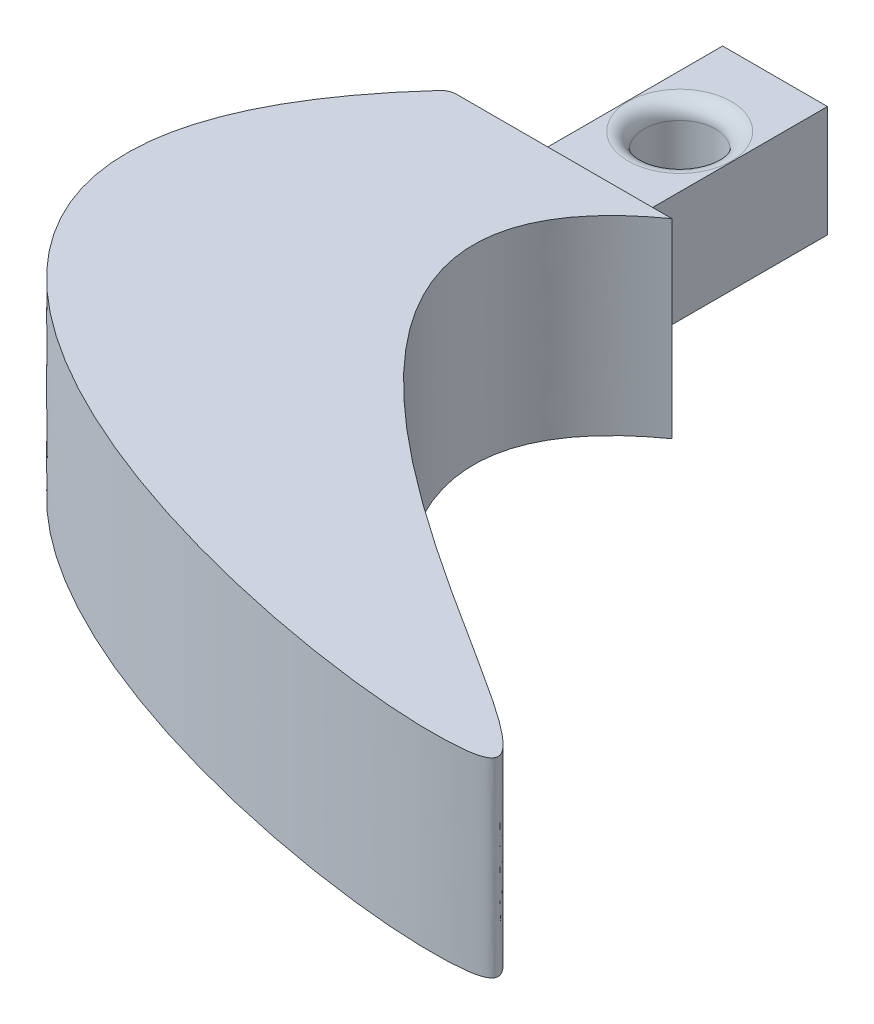
ISO-10303-21;
HEADER;
FILE_DESCRIPTION(('STEP AP214'),'2;1');
FILE_NAME('part.step','',(''),(''),'','','');
FILE_SCHEMA(('AUTOMOTIVE_DESIGN { 1 0 10303 214 1 1 1 1 }'));
ENDSEC;
DATA;
#1=APPLICATION_CONTEXT('core data for automotive mechanical design processes');
#2=APPLICATION_PROTOCOL_DEFINITION('international standard','automotive_design',2000,#1);
#3=PRODUCT_CONTEXT('',#1,'mechanical');
#4=PRODUCT('Part','Part','',(#3));
#5=PRODUCT_RELATED_PRODUCT_CATEGORY('part','',(#4));
#6=PRODUCT_DEFINITION_FORMATION('','',#4);
#7=PRODUCT_DEFINITION_CONTEXT('part definition',#1,'design');
#8=PRODUCT_DEFINITION('design','',#6,#7);
#9=PRODUCT_DEFINITION_SHAPE('','',#8);
#10=(LENGTH_UNIT() NAMED_UNIT(*) SI_UNIT(.MILLI.,.METRE.));
#11=(NAMED_UNIT(*) PLANE_ANGLE_UNIT() SI_UNIT($,.RADIAN.));
#12=(NAMED_UNIT(*) SI_UNIT($,.STERADIAN.) SOLID_ANGLE_UNIT());
#13=UNCERTAINTY_MEASURE_WITH_UNIT(LENGTH_MEASURE(1.E-05),#10,'distance_accuracy_value','');
#14=(GEOMETRIC_REPRESENTATION_CONTEXT(3) GLOBAL_UNCERTAINTY_ASSIGNED_CONTEXT((#13)) GLOBAL_UNIT_ASSIGNED_CONTEXT((#10,
#11,#12)) REPRESENTATION_CONTEXT('',''));
#15=CARTESIAN_POINT('',(0.,0.,0.));
#16=DIRECTION('',(0.,0.,1.));
#17=DIRECTION('',(1.,0.,0.));
#18=AXIS2_PLACEMENT_3D('',#15,#16,#17);
#19=CARTESIAN_POINT('',(2.99181733122528,-3.99279277164537,14.));
#20=DIRECTION('',(0.,1.,0.));
#21=DIRECTION('',(-1.,0.,0.));
#22=AXIS2_PLACEMENT_3D('',#19,#20,#21);
#23=PLANE('',#22);
#24=CARTESIAN_POINT('',(-0.508182668774722,-3.99279277164539,6.));
#25=DIRECTION('',(0.,1.,0.));
#26=DIRECTION('',(-1.,0.,0.));
#27=AXIS2_PLACEMENT_3D('',#24,#25,#26);
#28=CIRCLE('',#27,3.25);
#29=CARTESIAN_POINT('',(-3.75818266877472,-3.99279277164539,6.));
#30=VERTEX_POINT('',#29);
#31=EDGE_CURVE('E150',#30,#30,#28,.T.);
#32=ORIENTED_EDGE('',*,*,#31,.T.);
#33=EDGE_LOOP('',(#32));
#34=FACE_BOUND('',#33,.T.);
#35=DIRECTION('',(0.,0.,1.));
#36=VECTOR('',#35,1.);
#37=CARTESIAN_POINT('',(-3.80818266877472,-3.99279277164537,14.));
#38=LINE('',#37,#36);
#39=CARTESIAN_POINT('',(-3.80818266877472,-3.99279277164539,0.));
#40=VERTEX_POINT('',#39);
#41=CARTESIAN_POINT('',(-3.80818266877472,-3.99279277164537,14.));
#42=VERTEX_POINT('',#41);
#43=EDGE_CURVE('E174',#40,#42,#38,.T.);
#44=ORIENTED_EDGE('',*,*,#43,.F.);
#45=DIRECTION('',(1.,0.,0.));
#46=VECTOR('',#45,1.);
#47=CARTESIAN_POINT('',(2.99181733122528,-3.99279277164539,0.));
#48=LINE('',#47,#46);
#49=CARTESIAN_POINT('',(2.79181733122528,-3.99279277164539,0.));
#50=VERTEX_POINT('',#49);
#51=EDGE_CURVE('E120',#40,#50,#48,.T.);
#52=ORIENTED_EDGE('',*,*,#51,.T.);
#53=DIRECTION('',(0.,0.,1.));
#54=VECTOR('',#53,1.);
#55=CARTESIAN_POINT('',(2.79181733122528,-3.99279277164537,14.));
#56=LINE('',#55,#54);
#57=CARTESIAN_POINT('',(2.79181733122528,-3.99279277164537,14.));
#58=VERTEX_POINT('',#57);
#59=EDGE_CURVE('E178',#50,#58,#56,.T.);
#60=ORIENTED_EDGE('',*,*,#59,.T.);
#61=DIRECTION('',(1.,0.,0.));
#62=VECTOR('',#61,1.);
#63=CARTESIAN_POINT('',(2.99181733122528,-3.99279277164537,14.));
#64=LINE('',#63,#62);
#65=EDGE_CURVE('E125',#42,#58,#64,.T.);
#66=ORIENTED_EDGE('',*,*,#65,.F.);
#67=EDGE_LOOP('',(#44,#52,#60,#66));
#68=FACE_BOUND('',#67,.T.);
#69=ADVANCED_FACE('F40',(#34,#68),#23,.F.);
#70=CARTESIAN_POINT('',(2.99181733122528,3.00720722835462,14.));
#71=DIRECTION('',(0.,-1.,0.));
#72=DIRECTION('',(1.,0.,0.));
#73=AXIS2_PLACEMENT_3D('',#70,#71,#72);
#74=PLANE('',#73);
#75=CARTESIAN_POINT('',(-0.508182668774722,3.00720722835462,6.));
#76=DIRECTION('',(0.,-1.,0.));
#77=DIRECTION('',(1.,0.,0.));
#78=AXIS2_PLACEMENT_3D('',#75,#76,#77);
#79=CIRCLE('',#78,3.25);
#80=CARTESIAN_POINT('',(2.74181733122528,3.00720722835462,6.));
#81=VERTEX_POINT('',#80);
#82=EDGE_CURVE('E11',#81,#81,#79,.T.);
#83=ORIENTED_EDGE('',*,*,#82,.T.);
#84=EDGE_LOOP('',(#83));
#85=FACE_BOUND('',#84,.T.);
#86=DIRECTION('',(0.,0.,1.));
#87=VECTOR('',#86,1.);
#88=CARTESIAN_POINT('',(-3.80818266877472,3.00720722835461,0.));
#89=LINE('',#88,#87);
#90=CARTESIAN_POINT('',(-3.80818266877472,3.00720722835461,0.));
#91=VERTEX_POINT('',#90);
#92=CARTESIAN_POINT('',(-3.80818266877472,3.00720722835461,14.));
#93=VERTEX_POINT('',#92);
#94=EDGE_CURVE('E100',#91,#93,#89,.T.);
#95=ORIENTED_EDGE('',*,*,#94,.T.);
#96=DIRECTION('',(-1.,0.,0.));
#97=VECTOR('',#96,1.);
#98=CARTESIAN_POINT('',(2.99181733122528,3.00720722835462,14.));
#99=LINE('',#98,#97);
#100=CARTESIAN_POINT('',(2.79181733122528,3.00720722835461,14.));
#101=VERTEX_POINT('',#100);
#102=EDGE_CURVE('E131',#101,#93,#99,.T.);
#103=ORIENTED_EDGE('',*,*,#102,.F.);
#104=DIRECTION('',(0.,0.,1.));
#105=VECTOR('',#104,1.);
#106=CARTESIAN_POINT('',(2.79181733122528,3.00720722835461,0.));
#107=LINE('',#106,#105);
#108=CARTESIAN_POINT('',(2.79181733122528,3.00720722835461,0.));
#109=VERTEX_POINT('',#108);
#110=EDGE_CURVE('E56',#109,#101,#107,.T.);
#111=ORIENTED_EDGE('',*,*,#110,.F.);
#112=DIRECTION('',(-1.,0.,0.));
#113=VECTOR('',#112,1.);
#114=CARTESIAN_POINT('',(2.99181733122528,3.00720722835461,0.));
#115=LINE('',#114,#113);
#116=EDGE_CURVE('E118',#109,#91,#115,.T.);
#117=ORIENTED_EDGE('',*,*,#116,.T.);
#118=EDGE_LOOP('',(#95,#103,#111,#117));
#119=FACE_BOUND('',#118,.T.);
#120=ADVANCED_FACE('F123',(#85,#119),#74,.F.);
#121=CARTESIAN_POINT('',(0.,0.,0.));
#122=DIRECTION('',(0.,0.,1.));
#123=DIRECTION('',(1.,0.,0.));
#124=AXIS2_PLACEMENT_3D('',#121,#122,#123);
#125=PLANE('',#124);
#126=DIRECTION('',(0.,1.,0.));
#127=VECTOR('',#126,1.);
#128=CARTESIAN_POINT('',(-3.80818266877472,-6.99279277164539,0.));
#129=LINE('',#128,#127);
#130=EDGE_CURVE('E103',#40,#91,#129,.T.);
#131=ORIENTED_EDGE('',*,*,#130,.T.);
#132=ORIENTED_EDGE('',*,*,#116,.F.);
#133=DIRECTION('',(0.,1.,0.));
#134=VECTOR('',#133,1.);
#135=CARTESIAN_POINT('',(2.79181733122528,-6.99279277164539,0.));
#136=LINE('',#135,#134);
#137=EDGE_CURVE('E241',#50,#109,#136,.T.);
#138=ORIENTED_EDGE('',*,*,#137,.F.);
#139=ORIENTED_EDGE('',*,*,#51,.F.);
#140=EDGE_LOOP('',(#131,#132,#138,#139));
#141=FACE_BOUND('',#140,.T.);
#142=ADVANCED_FACE('F116',(#141),#125,.F.);
#143=CARTESIAN_POINT('',(-7.00000000000001,6.00000000000001,14.));
#144=DIRECTION('',(0.,0.,1.));
#145=DIRECTION('',(1.,0.,0.));
#146=AXIS2_PLACEMENT_3D('',#143,#144,#145);
#147=PLANE('',#146);
#148=DIRECTION('',(0.,1.,0.));
#149=VECTOR('',#148,1.);
#150=CARTESIAN_POINT('',(-3.80818266877472,-6.99279277164537,14.));
#151=LINE('',#150,#149);
#152=EDGE_CURVE('E106',#42,#93,#151,.T.);
#153=ORIENTED_EDGE('',*,*,#152,.F.);
#154=ORIENTED_EDGE('',*,*,#65,.T.);
#155=DIRECTION('',(0.,1.,0.));
#156=VECTOR('',#155,1.);
#157=CARTESIAN_POINT('',(2.79181733122528,-6.99279277164537,14.));
#158=LINE('',#157,#156);
#159=EDGE_CURVE('E239',#58,#101,#158,.T.);
#160=ORIENTED_EDGE('',*,*,#159,.T.);
#161=ORIENTED_EDGE('',*,*,#102,.T.);
#162=EDGE_LOOP('',(#153,#154,#160,#161));
#163=FACE_BOUND('',#162,.T.);
#164=DIRECTION('',(-1.,0.,0.));
#165=VECTOR('',#164,1.);
#166=CARTESIAN_POINT('',(-7.,-6.,14.));
#167=LINE('',#166,#165);
#168=CARTESIAN_POINT('',(7.,-5.99999999999998,14.));
#169=VERTEX_POINT('',#168);
#170=CARTESIAN_POINT('',(-6.56109821426192,-6.,14.));
#171=VERTEX_POINT('',#170);
#172=EDGE_CURVE('E183',#169,#171,#167,.T.);
#173=ORIENTED_EDGE('',*,*,#172,.T.);
#174=DIRECTION('',(0.,-1.,0.));
#175=VECTOR('',#174,1.);
#176=CARTESIAN_POINT('',(-6.56109821426193,6.00000000000001,14.));
#177=LINE('',#176,#175);
#178=CARTESIAN_POINT('',(-6.56109821426193,6.00000000000001,14.));
#179=VERTEX_POINT('',#178);
#180=EDGE_CURVE('E64',#171,#179,#177,.F.);
#181=ORIENTED_EDGE('',*,*,#180,.T.);
#182=DIRECTION('',(-1.,0.,0.));
#183=VECTOR('',#182,1.);
#184=CARTESIAN_POINT('',(-7.00000000000001,6.00000000000001,14.));
#185=LINE('',#184,#183);
#186=CARTESIAN_POINT('',(7.,6.00000000000001,14.));
#187=VERTEX_POINT('',#186);
#188=EDGE_CURVE('E194',#187,#179,#185,.T.);
#189=ORIENTED_EDGE('',*,*,#188,.F.);
#190=DIRECTION('',(0.,-1.,0.));
#191=VECTOR('',#190,1.);
#192=CARTESIAN_POINT('',(7.,6.00000000000001,14.));
#193=LINE('',#192,#191);
#194=EDGE_CURVE('E133',#187,#169,#193,.T.);
#195=ORIENTED_EDGE('',*,*,#194,.T.);
#196=EDGE_LOOP('',(#173,#181,#189,#195));
#197=FACE_BOUND('',#196,.T.);
#198=ADVANCED_FACE('F204',(#163,#197),#147,.F.);
#199=CARTESIAN_POINT('',(-7.00000000000001,6.00000000000001,14.));
#200=CARTESIAN_POINT('',(-31.4958981215541,6.00000000000001,40.3702439445926));
#201=CARTESIAN_POINT('',(23.1189520242879,6.00000000000001,51.4870819089952));
#202=CARTESIAN_POINT('',(36.0352401510132,6.00000000000001,47.7315303098085));
#203=CARTESIAN_POINT('',(-11.6768612752933,6.,27.3191316348009));
#204=CARTESIAN_POINT('',(7.,6.00000000000001,14.));
#205=B_SPLINE_CURVE_WITH_KNOTS('',3,(#199,#200,#201,#202,#203,#204),.UNSPECIFIED.,.F.,.F.,(4,1,
1,4),(0.,0.550644378879297,0.609171061517606,1.),.UNSPECIFIED.);
#206=DIRECTION('',(0.,-1.,0.));
#207=VECTOR('',#206,1.);
#208=SURFACE_OF_LINEAR_EXTRUSION('',#205,#207);
#209=CARTESIAN_POINT('',(-7.30053427551908,6.00000000000001,14.3267732095998));
#210=VERTEX_POINT('',#209);
#211=EDGE_CURVE('E188',#210,#187,#205,.T.);
#212=ORIENTED_EDGE('',*,*,#211,.F.);
#213=DIRECTION('',(0.,-1.,0.));
#214=VECTOR('',#213,1.);
#215=CARTESIAN_POINT('',(-7.30053427551965,6.00000000000001,14.3267732096005));
#216=LINE('',#215,#214);
#217=CARTESIAN_POINT('',(-7.30053427551907,-6.,14.3267732095998));
#218=VERTEX_POINT('',#217);
#219=EDGE_CURVE('E137',#210,#218,#216,.T.);
#220=ORIENTED_EDGE('',*,*,#219,.T.);
#221=CARTESIAN_POINT('',(-7.,-6.,14.));
#222=CARTESIAN_POINT('',(-31.4958981215541,-6.00000000000001,40.3702439445925));
#223=CARTESIAN_POINT('',(23.1189520242879,-5.99999999999998,51.4870819089952));
#224=CARTESIAN_POINT('',(36.0352401510132,-5.99999999999999,47.7315303098085));
#225=CARTESIAN_POINT('',(-11.6768612752933,-6.,27.3191316348008));
#226=CARTESIAN_POINT('',(7.,-5.99999999999998,14.));
#227=B_SPLINE_CURVE_WITH_KNOTS('',3,(#221,#222,#223,#224,#225,#226),.UNSPECIFIED.,.F.,.F.,(4,1,
1,4),(0.,0.550644378879297,0.609171061517606,1.),.UNSPECIFIED.);
#228=EDGE_CURVE('E177',#218,#169,#227,.T.);
#229=ORIENTED_EDGE('',*,*,#228,.T.);
#230=ORIENTED_EDGE('',*,*,#194,.F.);
#231=EDGE_LOOP('',(#212,#220,#229,#230));
#232=FACE_BOUND('',#231,.T.);
#233=ADVANCED_FACE('F199',(#232),#208,.F.);
#234=CARTESIAN_POINT('',(25.0791084804158,6.00000000000001,49.4824416186944));
#235=DIRECTION('',(0.,-1.,0.));
#236=DIRECTION('',(0.,0.,-1.));
#237=AXIS2_PLACEMENT_3D('',#234,#235,#236);
#238=PLANE('',#237);
#239=ORIENTED_EDGE('',*,*,#188,.T.);
#240=CARTESIAN_POINT('',(-6.56109821426193,6.00000000000001,15.));
#241=DIRECTION('',(0.,-1.,0.));
#242=DIRECTION('',(0.,0.,-1.));
#243=AXIS2_PLACEMENT_3D('',#240,#241,#242);
#244=CIRCLE('',#243,1.);
#245=EDGE_CURVE('E147',#179,#210,#244,.F.);
#246=ORIENTED_EDGE('',*,*,#245,.T.);
#247=ORIENTED_EDGE('',*,*,#211,.T.);
#248=EDGE_LOOP('',(#239,#246,#247));
#249=FACE_BOUND('',#248,.T.);
#250=ADVANCED_FACE('F203',(#249),#238,.F.);
#251=CARTESIAN_POINT('',(25.0791084804158,-5.99999999999998,49.4824416186944));
#252=DIRECTION('',(0.,-1.,0.));
#253=DIRECTION('',(0.,0.,-1.));
#254=AXIS2_PLACEMENT_3D('',#251,#252,#253);
#255=PLANE('',#254);
#256=ORIENTED_EDGE('',*,*,#228,.F.);
#257=CARTESIAN_POINT('',(-6.56109821426192,-6.,15.));
#258=DIRECTION('',(0.,-1.,0.));
#259=DIRECTION('',(0.,0.,-1.));
#260=AXIS2_PLACEMENT_3D('',#257,#258,#259);
#261=CIRCLE('',#260,1.);
#262=EDGE_CURVE('E141',#218,#171,#261,.T.);
#263=ORIENTED_EDGE('',*,*,#262,.T.);
#264=ORIENTED_EDGE('',*,*,#172,.F.);
#265=EDGE_LOOP('',(#256,#263,#264));
#266=FACE_BOUND('',#265,.T.);
#267=ADVANCED_FACE('F221',(#266),#255,.T.);
#268=CARTESIAN_POINT('',(-0.508182668774722,-2.99279277164539,6.));
#269=DIRECTION('',(0.,1.,0.));
#270=DIRECTION('',(0.,0.,1.));
#271=AXIS2_PLACEMENT_3D('',#268,#269,#270);
#272=CYLINDRICAL_SURFACE('',#271,2.25);
#273=CARTESIAN_POINT('',(-0.508182668774722,-2.99279277164539,6.));
#274=DIRECTION('',(0.,1.,0.));
#275=DIRECTION('',(-1.,0.,0.));
#276=AXIS2_PLACEMENT_3D('',#273,#274,#275);
#277=CIRCLE('',#276,2.25);
#278=CARTESIAN_POINT('',(-2.75818266877472,-2.99279277164539,6.));
#279=VERTEX_POINT('',#278);
#280=EDGE_CURVE('E49',#279,#279,#277,.F.);
#281=ORIENTED_EDGE('',*,*,#280,.T.);
#282=EDGE_LOOP('',(#281));
#283=FACE_BOUND('',#282,.T.);
#284=CARTESIAN_POINT('',(-0.508182668774722,2.00720722835461,6.));
#285=DIRECTION('',(0.,-1.,0.));
#286=DIRECTION('',(1.,0.,0.));
#287=AXIS2_PLACEMENT_3D('',#284,#285,#286);
#288=CIRCLE('',#287,2.25);
#289=CARTESIAN_POINT('',(1.74181733122528,2.00720722835461,6.));
#290=VERTEX_POINT('',#289);
#291=EDGE_CURVE('E154',#290,#290,#288,.F.);
#292=ORIENTED_EDGE('',*,*,#291,.T.);
#293=EDGE_LOOP('',(#292));
#294=FACE_BOUND('',#293,.T.);
#295=ADVANCED_FACE('F162',(#283,#294),#272,.F.);
#296=CARTESIAN_POINT('',(-6.56109821426192,0.,15.));
#297=DIRECTION('',(0.,-1.,0.));
#298=DIRECTION('',(0.,0.,-1.));
#299=AXIS2_PLACEMENT_3D('',#296,#297,#298);
#300=CYLINDRICAL_SURFACE('',#299,1.);
#301=ORIENTED_EDGE('',*,*,#245,.F.);
#302=ORIENTED_EDGE('',*,*,#180,.F.);
#303=ORIENTED_EDGE('',*,*,#262,.F.);
#304=ORIENTED_EDGE('',*,*,#219,.F.);
#305=EDGE_LOOP('',(#301,#302,#303,#304));
#306=FACE_BOUND('',#305,.T.);
#307=ADVANCED_FACE('F212',(#306),#300,.T.);
#308=CARTESIAN_POINT('',(2.79181733122528,-6.99279277164539,0.));
#309=DIRECTION('',(-1.,0.,0.));
#310=DIRECTION('',(0.,-1.,0.));
#311=AXIS2_PLACEMENT_3D('',#308,#309,#310);
#312=PLANE('',#311);
#313=ORIENTED_EDGE('',*,*,#137,.T.);
#314=ORIENTED_EDGE('',*,*,#110,.T.);
#315=ORIENTED_EDGE('',*,*,#159,.F.);
#316=ORIENTED_EDGE('',*,*,#59,.F.);
#317=EDGE_LOOP('',(#313,#314,#315,#316));
#318=FACE_BOUND('',#317,.T.);
#319=ADVANCED_FACE('F214',(#318),#312,.F.);
#320=CARTESIAN_POINT('',(-3.80818266877472,-6.99279277164539,0.));
#321=DIRECTION('',(-1.,0.,0.));
#322=DIRECTION('',(0.,-1.,0.));
#323=AXIS2_PLACEMENT_3D('',#320,#321,#322);
#324=PLANE('',#323);
#325=ORIENTED_EDGE('',*,*,#43,.T.);
#326=ORIENTED_EDGE('',*,*,#152,.T.);
#327=ORIENTED_EDGE('',*,*,#94,.F.);
#328=ORIENTED_EDGE('',*,*,#130,.F.);
#329=EDGE_LOOP('',(#325,#326,#327,#328));
#330=FACE_BOUND('',#329,.T.);
#331=ADVANCED_FACE('F102',(#330),#324,.T.);
#332=CARTESIAN_POINT('',(-0.508182668774722,-2.99279277164539,6.));
#333=DIRECTION('',(0.,1.,0.));
#334=DIRECTION('',(-1.,0.,0.));
#335=AXIS2_PLACEMENT_3D('',#332,#333,#334);
#336=TOROIDAL_SURFACE('',#335,3.25,1.);
#337=ORIENTED_EDGE('',*,*,#280,.F.);
#338=EDGE_LOOP('',(#337));
#339=FACE_BOUND('',#338,.T.);
#340=ORIENTED_EDGE('',*,*,#31,.F.);
#341=EDGE_LOOP('',(#340));
#342=FACE_BOUND('',#341,.T.);
#343=ADVANCED_FACE('F165',(#339,#342),#336,.T.);
#344=CARTESIAN_POINT('',(-0.508182668774722,2.00720722835461,6.));
#345=DIRECTION('',(0.,-1.,0.));
#346=DIRECTION('',(1.,0.,0.));
#347=AXIS2_PLACEMENT_3D('',#344,#345,#346);
#348=TOROIDAL_SURFACE('',#347,3.25,1.);
#349=ORIENTED_EDGE('',*,*,#291,.F.);
#350=EDGE_LOOP('',(#349));
#351=FACE_BOUND('',#350,.T.);
#352=ORIENTED_EDGE('',*,*,#82,.F.);
#353=EDGE_LOOP('',(#352));
#354=FACE_BOUND('',#353,.T.);
#355=ADVANCED_FACE('F42',(#351,#354),#348,.T.);
#356=CLOSED_SHELL('',(#69,#120,#142,#198,#233,#250,#267,#295,#307,#319,#331,#343,#355));
#357=MANIFOLD_SOLID_BREP('B2',#356);
#358=ADVANCED_BREP_SHAPE_REPRESENTATION('',(#18,#357),#14);
#359=SHAPE_DEFINITION_REPRESENTATION(#9,#358);
ENDSEC;
END-ISO-10303-21;
